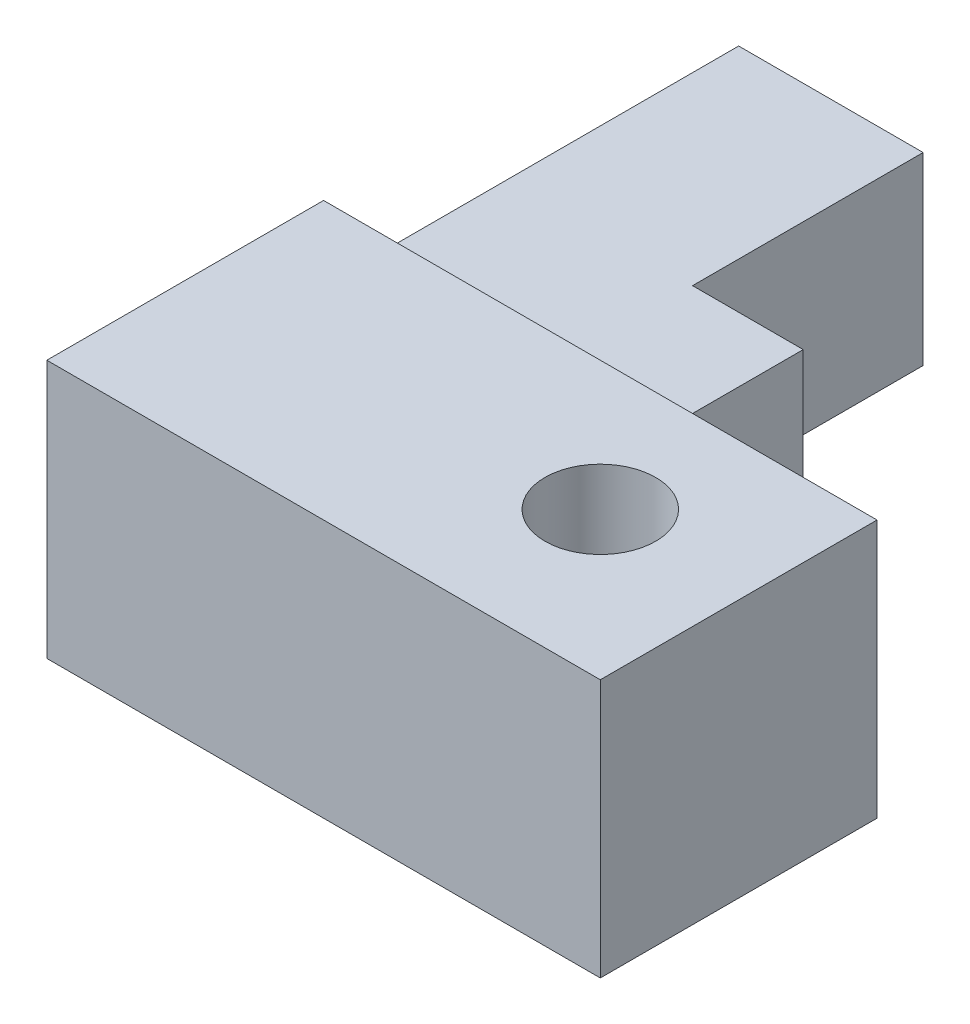
ISO-10303-21;
HEADER;
FILE_DESCRIPTION(('STEP AP214'),'2;1');
FILE_NAME('part.step','',(''),(''),'','','');
FILE_SCHEMA(('AUTOMOTIVE_DESIGN { 1 0 10303 214 1 1 1 1 }'));
ENDSEC;
DATA;
#1=APPLICATION_CONTEXT('core data for automotive mechanical design processes');
#2=APPLICATION_PROTOCOL_DEFINITION('international standard','automotive_design',2000,#1);
#3=PRODUCT_CONTEXT('',#1,'mechanical');
#4=PRODUCT('Part','Part','',(#3));
#5=PRODUCT_RELATED_PRODUCT_CATEGORY('part','',(#4));
#6=PRODUCT_DEFINITION_FORMATION('','',#4);
#7=PRODUCT_DEFINITION_CONTEXT('part definition',#1,'design');
#8=PRODUCT_DEFINITION('design','',#6,#7);
#9=PRODUCT_DEFINITION_SHAPE('','',#8);
#10=(LENGTH_UNIT() NAMED_UNIT(*) SI_UNIT(.MILLI.,.METRE.));
#11=(NAMED_UNIT(*) PLANE_ANGLE_UNIT() SI_UNIT($,.RADIAN.));
#12=(NAMED_UNIT(*) SI_UNIT($,.STERADIAN.) SOLID_ANGLE_UNIT());
#13=UNCERTAINTY_MEASURE_WITH_UNIT(LENGTH_MEASURE(1.E-05),#10,'distance_accuracy_value','');
#14=(GEOMETRIC_REPRESENTATION_CONTEXT(3) GLOBAL_UNCERTAINTY_ASSIGNED_CONTEXT((#13)) GLOBAL_UNIT_ASSIGNED_CONTEXT((#10,
#11,#12)) REPRESENTATION_CONTEXT('',''));
#15=CARTESIAN_POINT('',(0.,0.,0.));
#16=DIRECTION('',(0.,0.,1.));
#17=DIRECTION('',(1.,0.,0.));
#18=AXIS2_PLACEMENT_3D('',#15,#16,#17);
#19=CARTESIAN_POINT('',(0.,20.,0.));
#20=DIRECTION('',(-1.,0.,0.));
#21=DIRECTION('',(0.,0.,1.));
#22=AXIS2_PLACEMENT_3D('',#19,#20,#21);
#23=PLANE('',#22);
#24=DIRECTION('',(0.,-1.,0.));
#25=VECTOR('',#24,1.);
#26=CARTESIAN_POINT('',(0.,20.,-75.));
#27=LINE('',#26,#25);
#28=CARTESIAN_POINT('',(0.,20.,-75.));
#29=VERTEX_POINT('',#28);
#30=CARTESIAN_POINT('',(0.,0.,-75.));
#31=VERTEX_POINT('',#30);
#32=EDGE_CURVE('E154',#29,#31,#27,.T.);
#33=ORIENTED_EDGE('',*,*,#32,.T.);
#34=DIRECTION('',(0.,0.,-1.));
#35=VECTOR('',#34,1.);
#36=CARTESIAN_POINT('',(0.,0.,0.));
#37=LINE('',#36,#35);
#38=CARTESIAN_POINT('',(0.,0.,0.));
#39=VERTEX_POINT('',#38);
#40=EDGE_CURVE('E105',#39,#31,#37,.T.);
#41=ORIENTED_EDGE('',*,*,#40,.F.);
#42=DIRECTION('',(0.,-1.,0.));
#43=VECTOR('',#42,1.);
#44=CARTESIAN_POINT('',(0.,20.,0.));
#45=LINE('',#44,#43);
#46=CARTESIAN_POINT('',(0.,28.,0.));
#47=VERTEX_POINT('',#46);
#48=EDGE_CURVE('E11',#47,#39,#45,.T.);
#49=ORIENTED_EDGE('',*,*,#48,.F.);
#50=DIRECTION('',(0.,0.,-1.));
#51=VECTOR('',#50,1.);
#52=CARTESIAN_POINT('',(0.,28.,0.));
#53=LINE('',#52,#51);
#54=CARTESIAN_POINT('',(0.,28.,-30.));
#55=VERTEX_POINT('',#54);
#56=EDGE_CURVE('E254',#47,#55,#53,.T.);
#57=ORIENTED_EDGE('',*,*,#56,.T.);
#58=DIRECTION('',(0.,-1.,0.));
#59=VECTOR('',#58,1.);
#60=CARTESIAN_POINT('',(0.,28.,-30.));
#61=LINE('',#60,#59);
#62=CARTESIAN_POINT('',(0.,20.,-30.));
#63=VERTEX_POINT('',#62);
#64=EDGE_CURVE('E247',#55,#63,#61,.T.);
#65=ORIENTED_EDGE('',*,*,#64,.T.);
#66=DIRECTION('',(0.,0.,-1.));
#67=VECTOR('',#66,1.);
#68=CARTESIAN_POINT('',(0.,20.,0.));
#69=LINE('',#68,#67);
#70=EDGE_CURVE('E62',#63,#29,#69,.T.);
#71=ORIENTED_EDGE('',*,*,#70,.T.);
#72=EDGE_LOOP('',(#33,#41,#49,#57,#65,#71));
#73=FACE_BOUND('',#72,.T.);
#74=ADVANCED_FACE('F45',(#73),#23,.T.);
#75=CARTESIAN_POINT('',(0.,20.,0.));
#76=DIRECTION('',(0.,0.,1.));
#77=DIRECTION('',(1.,0.,0.));
#78=AXIS2_PLACEMENT_3D('',#75,#76,#77);
#79=PLANE('',#78);
#80=DIRECTION('',(-1.,0.,0.));
#81=VECTOR('',#80,1.);
#82=CARTESIAN_POINT('',(0.,0.,0.));
#83=LINE('',#82,#81);
#84=CARTESIAN_POINT('',(60.,0.,0.));
#85=VERTEX_POINT('',#84);
#86=EDGE_CURVE('E160',#85,#39,#83,.T.);
#87=ORIENTED_EDGE('',*,*,#86,.F.);
#88=DIRECTION('',(0.,-1.,0.));
#89=VECTOR('',#88,1.);
#90=CARTESIAN_POINT('',(60.,20.,0.));
#91=LINE('',#90,#89);
#92=CARTESIAN_POINT('',(60.,28.,0.));
#93=VERTEX_POINT('',#92);
#94=EDGE_CURVE('E54',#93,#85,#91,.T.);
#95=ORIENTED_EDGE('',*,*,#94,.F.);
#96=DIRECTION('',(-1.,0.,0.));
#97=VECTOR('',#96,1.);
#98=CARTESIAN_POINT('',(0.,28.,0.));
#99=LINE('',#98,#97);
#100=EDGE_CURVE('E259',#93,#47,#99,.T.);
#101=ORIENTED_EDGE('',*,*,#100,.T.);
#102=ORIENTED_EDGE('',*,*,#48,.T.);
#103=EDGE_LOOP('',(#87,#95,#101,#102));
#104=FACE_BOUND('',#103,.T.);
#105=ADVANCED_FACE('F226',(#104),#79,.T.);
#106=CARTESIAN_POINT('',(60.,20.,0.));
#107=DIRECTION('',(1.,0.,0.));
#108=DIRECTION('',(0.,0.,-1.));
#109=AXIS2_PLACEMENT_3D('',#106,#107,#108);
#110=PLANE('',#109);
#111=DIRECTION('',(0.,0.,1.));
#112=VECTOR('',#111,1.);
#113=CARTESIAN_POINT('',(60.,0.,0.));
#114=LINE('',#113,#112);
#115=CARTESIAN_POINT('',(60.,0.,-30.));
#116=VERTEX_POINT('',#115);
#117=EDGE_CURVE('E164',#116,#85,#114,.T.);
#118=ORIENTED_EDGE('',*,*,#117,.F.);
#119=DIRECTION('',(0.,-1.,0.));
#120=VECTOR('',#119,1.);
#121=CARTESIAN_POINT('',(60.,20.,-30.));
#122=LINE('',#121,#120);
#123=CARTESIAN_POINT('',(60.,28.,-30.));
#124=VERTEX_POINT('',#123);
#125=EDGE_CURVE('E210',#124,#116,#122,.T.);
#126=ORIENTED_EDGE('',*,*,#125,.F.);
#127=DIRECTION('',(0.,0.,1.));
#128=VECTOR('',#127,1.);
#129=CARTESIAN_POINT('',(60.,28.,0.));
#130=LINE('',#129,#128);
#131=EDGE_CURVE('E222',#124,#93,#130,.T.);
#132=ORIENTED_EDGE('',*,*,#131,.T.);
#133=ORIENTED_EDGE('',*,*,#94,.T.);
#134=EDGE_LOOP('',(#118,#126,#132,#133));
#135=FACE_BOUND('',#134,.T.);
#136=ADVANCED_FACE('F218',(#135),#110,.T.);
#137=CARTESIAN_POINT('',(0.,20.,-30.));
#138=DIRECTION('',(0.,0.,-1.));
#139=DIRECTION('',(-1.,0.,0.));
#140=AXIS2_PLACEMENT_3D('',#137,#138,#139);
#141=PLANE('',#140);
#142=DIRECTION('',(1.,0.,0.));
#143=VECTOR('',#142,1.);
#144=CARTESIAN_POINT('',(0.,0.,-30.));
#145=LINE('',#144,#143);
#146=CARTESIAN_POINT('',(48.,0.,-30.));
#147=VERTEX_POINT('',#146);
#148=EDGE_CURVE('E168',#147,#116,#145,.T.);
#149=ORIENTED_EDGE('',*,*,#148,.F.);
#150=DIRECTION('',(0.,-1.,0.));
#151=VECTOR('',#150,1.);
#152=CARTESIAN_POINT('',(48.,20.,-30.));
#153=LINE('',#152,#151);
#154=CARTESIAN_POINT('',(48.,20.,-30.));
#155=VERTEX_POINT('',#154);
#156=EDGE_CURVE('E207',#155,#147,#153,.T.);
#157=ORIENTED_EDGE('',*,*,#156,.F.);
#158=DIRECTION('',(-1.,0.,0.));
#159=VECTOR('',#158,1.);
#160=CARTESIAN_POINT('',(0.,20.,-30.));
#161=LINE('',#160,#159);
#162=EDGE_CURVE('E161',#155,#63,#161,.T.);
#163=ORIENTED_EDGE('',*,*,#162,.T.);
#164=ORIENTED_EDGE('',*,*,#64,.F.);
#165=DIRECTION('',(1.,0.,0.));
#166=VECTOR('',#165,1.);
#167=CARTESIAN_POINT('',(0.,28.,-30.));
#168=LINE('',#167,#166);
#169=EDGE_CURVE('E239',#55,#124,#168,.T.);
#170=ORIENTED_EDGE('',*,*,#169,.T.);
#171=ORIENTED_EDGE('',*,*,#125,.T.);
#172=EDGE_LOOP('',(#149,#157,#163,#164,#170,#171));
#173=FACE_BOUND('',#172,.T.);
#174=ADVANCED_FACE('F233',(#173),#141,.T.);
#175=CARTESIAN_POINT('',(48.,20.,0.));
#176=DIRECTION('',(1.,0.,0.));
#177=DIRECTION('',(0.,0.,-1.));
#178=AXIS2_PLACEMENT_3D('',#175,#176,#177);
#179=PLANE('',#178);
#180=DIRECTION('',(0.,0.,1.));
#181=VECTOR('',#180,1.);
#182=CARTESIAN_POINT('',(48.,0.,0.));
#183=LINE('',#182,#181);
#184=CARTESIAN_POINT('',(48.,0.,-38.));
#185=VERTEX_POINT('',#184);
#186=EDGE_CURVE('E172',#185,#147,#183,.T.);
#187=ORIENTED_EDGE('',*,*,#186,.F.);
#188=DIRECTION('',(0.,-1.,0.));
#189=VECTOR('',#188,1.);
#190=CARTESIAN_POINT('',(48.,20.,-38.));
#191=LINE('',#190,#189);
#192=CARTESIAN_POINT('',(48.,20.,-38.));
#193=VERTEX_POINT('',#192);
#194=EDGE_CURVE('E112',#193,#185,#191,.T.);
#195=ORIENTED_EDGE('',*,*,#194,.F.);
#196=DIRECTION('',(0.,0.,1.));
#197=VECTOR('',#196,1.);
#198=CARTESIAN_POINT('',(48.,20.,0.));
#199=LINE('',#198,#197);
#200=EDGE_CURVE('E271',#193,#155,#199,.T.);
#201=ORIENTED_EDGE('',*,*,#200,.T.);
#202=ORIENTED_EDGE('',*,*,#156,.T.);
#203=EDGE_LOOP('',(#187,#195,#201,#202));
#204=FACE_BOUND('',#203,.T.);
#205=ADVANCED_FACE('F285',(#204),#179,.T.);
#206=CARTESIAN_POINT('',(0.,20.,-38.));
#207=DIRECTION('',(0.,0.,-1.));
#208=DIRECTION('',(-1.,0.,0.));
#209=AXIS2_PLACEMENT_3D('',#206,#207,#208);
#210=PLANE('',#209);
#211=DIRECTION('',(1.,0.,0.));
#212=VECTOR('',#211,1.);
#213=CARTESIAN_POINT('',(0.,0.,-38.));
#214=LINE('',#213,#212);
#215=CARTESIAN_POINT('',(32.,0.,-38.));
#216=VERTEX_POINT('',#215);
#217=EDGE_CURVE('E176',#216,#185,#214,.T.);
#218=ORIENTED_EDGE('',*,*,#217,.F.);
#219=DIRECTION('',(0.,-1.,0.));
#220=VECTOR('',#219,1.);
#221=CARTESIAN_POINT('',(32.,20.,-38.));
#222=LINE('',#221,#220);
#223=CARTESIAN_POINT('',(32.,20.,-38.));
#224=VERTEX_POINT('',#223);
#225=EDGE_CURVE('E202',#224,#216,#222,.T.);
#226=ORIENTED_EDGE('',*,*,#225,.F.);
#227=DIRECTION('',(1.,0.,0.));
#228=VECTOR('',#227,1.);
#229=CARTESIAN_POINT('',(0.,20.,-38.));
#230=LINE('',#229,#228);
#231=EDGE_CURVE('E274',#224,#193,#230,.T.);
#232=ORIENTED_EDGE('',*,*,#231,.T.);
#233=ORIENTED_EDGE('',*,*,#194,.T.);
#234=EDGE_LOOP('',(#218,#226,#232,#233));
#235=FACE_BOUND('',#234,.T.);
#236=ADVANCED_FACE('F284',(#235),#210,.T.);
#237=CARTESIAN_POINT('',(32.,20.,0.));
#238=DIRECTION('',(1.,0.,0.));
#239=DIRECTION('',(0.,0.,-1.));
#240=AXIS2_PLACEMENT_3D('',#237,#238,#239);
#241=PLANE('',#240);
#242=DIRECTION('',(0.,0.,1.));
#243=VECTOR('',#242,1.);
#244=CARTESIAN_POINT('',(32.,0.,0.));
#245=LINE('',#244,#243);
#246=CARTESIAN_POINT('',(32.,0.,-50.));
#247=VERTEX_POINT('',#246);
#248=EDGE_CURVE('E180',#247,#216,#245,.T.);
#249=ORIENTED_EDGE('',*,*,#248,.F.);
#250=DIRECTION('',(0.,-1.,0.));
#251=VECTOR('',#250,1.);
#252=CARTESIAN_POINT('',(32.,20.,-50.));
#253=LINE('',#252,#251);
#254=CARTESIAN_POINT('',(32.,20.,-50.));
#255=VERTEX_POINT('',#254);
#256=EDGE_CURVE('E135',#255,#247,#253,.T.);
#257=ORIENTED_EDGE('',*,*,#256,.F.);
#258=DIRECTION('',(0.,0.,1.));
#259=VECTOR('',#258,1.);
#260=CARTESIAN_POINT('',(32.,20.,0.));
#261=LINE('',#260,#259);
#262=EDGE_CURVE('E146',#255,#224,#261,.T.);
#263=ORIENTED_EDGE('',*,*,#262,.T.);
#264=ORIENTED_EDGE('',*,*,#225,.T.);
#265=EDGE_LOOP('',(#249,#257,#263,#264));
#266=FACE_BOUND('',#265,.T.);
#267=ADVANCED_FACE('F280',(#266),#241,.T.);
#268=CARTESIAN_POINT('',(0.,20.,-50.));
#269=DIRECTION('',(0.,0.,-1.));
#270=DIRECTION('',(-1.,0.,0.));
#271=AXIS2_PLACEMENT_3D('',#268,#269,#270);
#272=PLANE('',#271);
#273=DIRECTION('',(1.,0.,0.));
#274=VECTOR('',#273,1.);
#275=CARTESIAN_POINT('',(0.,0.,-50.));
#276=LINE('',#275,#274);
#277=CARTESIAN_POINT('',(20.,0.,-50.));
#278=VERTEX_POINT('',#277);
#279=EDGE_CURVE('E130',#278,#247,#276,.T.);
#280=ORIENTED_EDGE('',*,*,#279,.F.);
#281=DIRECTION('',(0.,-1.,0.));
#282=VECTOR('',#281,1.);
#283=CARTESIAN_POINT('',(20.,20.,-50.));
#284=LINE('',#283,#282);
#285=CARTESIAN_POINT('',(20.,20.,-50.));
#286=VERTEX_POINT('',#285);
#287=EDGE_CURVE('E125',#286,#278,#284,.T.);
#288=ORIENTED_EDGE('',*,*,#287,.F.);
#289=DIRECTION('',(1.,0.,0.));
#290=VECTOR('',#289,1.);
#291=CARTESIAN_POINT('',(0.,20.,-50.));
#292=LINE('',#291,#290);
#293=EDGE_CURVE('E128',#286,#255,#292,.T.);
#294=ORIENTED_EDGE('',*,*,#293,.T.);
#295=ORIENTED_EDGE('',*,*,#256,.T.);
#296=EDGE_LOOP('',(#280,#288,#294,#295));
#297=FACE_BOUND('',#296,.T.);
#298=ADVANCED_FACE('F127',(#297),#272,.T.);
#299=CARTESIAN_POINT('',(20.,20.,0.));
#300=DIRECTION('',(1.,0.,0.));
#301=DIRECTION('',(0.,0.,-1.));
#302=AXIS2_PLACEMENT_3D('',#299,#300,#301);
#303=PLANE('',#302);
#304=DIRECTION('',(0.,0.,1.));
#305=VECTOR('',#304,1.);
#306=CARTESIAN_POINT('',(20.,0.,0.));
#307=LINE('',#306,#305);
#308=CARTESIAN_POINT('',(20.,0.,-75.));
#309=VERTEX_POINT('',#308);
#310=EDGE_CURVE('E186',#309,#278,#307,.T.);
#311=ORIENTED_EDGE('',*,*,#310,.F.);
#312=DIRECTION('',(0.,-1.,0.));
#313=VECTOR('',#312,1.);
#314=CARTESIAN_POINT('',(20.,20.,-75.));
#315=LINE('',#314,#313);
#316=CARTESIAN_POINT('',(20.,20.,-75.));
#317=VERTEX_POINT('',#316);
#318=EDGE_CURVE('E97',#317,#309,#315,.T.);
#319=ORIENTED_EDGE('',*,*,#318,.F.);
#320=DIRECTION('',(0.,0.,1.));
#321=VECTOR('',#320,1.);
#322=CARTESIAN_POINT('',(20.,20.,0.));
#323=LINE('',#322,#321);
#324=EDGE_CURVE('E143',#317,#286,#323,.T.);
#325=ORIENTED_EDGE('',*,*,#324,.T.);
#326=ORIENTED_EDGE('',*,*,#287,.T.);
#327=EDGE_LOOP('',(#311,#319,#325,#326));
#328=FACE_BOUND('',#327,.T.);
#329=ADVANCED_FACE('F149',(#328),#303,.T.);
#330=CARTESIAN_POINT('',(0.,20.,-75.));
#331=DIRECTION('',(0.,0.,-1.));
#332=DIRECTION('',(-1.,0.,0.));
#333=AXIS2_PLACEMENT_3D('',#330,#331,#332);
#334=PLANE('',#333);
#335=DIRECTION('',(1.,0.,0.));
#336=VECTOR('',#335,1.);
#337=CARTESIAN_POINT('',(0.,0.,-75.));
#338=LINE('',#337,#336);
#339=EDGE_CURVE('E189',#31,#309,#338,.T.);
#340=ORIENTED_EDGE('',*,*,#339,.F.);
#341=ORIENTED_EDGE('',*,*,#32,.F.);
#342=DIRECTION('',(1.,0.,0.));
#343=VECTOR('',#342,1.);
#344=CARTESIAN_POINT('',(0.,20.,-75.));
#345=LINE('',#344,#343);
#346=EDGE_CURVE('E151',#29,#317,#345,.T.);
#347=ORIENTED_EDGE('',*,*,#346,.T.);
#348=ORIENTED_EDGE('',*,*,#318,.T.);
#349=EDGE_LOOP('',(#340,#341,#347,#348));
#350=FACE_BOUND('',#349,.T.);
#351=ADVANCED_FACE('F282',(#350),#334,.T.);
#352=CARTESIAN_POINT('',(44.,20.,-16.));
#353=DIRECTION('',(0.,-1.,0.));
#354=DIRECTION('',(0.,0.,-1.));
#355=AXIS2_PLACEMENT_3D('',#352,#353,#354);
#356=CYLINDRICAL_SURFACE('',#355,6.00000000000001);
#357=CARTESIAN_POINT('',(44.,0.,-16.));
#358=DIRECTION('',(0.,1.,0.));
#359=DIRECTION('',(0.,0.,1.));
#360=AXIS2_PLACEMENT_3D('',#357,#358,#359);
#361=CIRCLE('',#360,6.00000000000001);
#362=CARTESIAN_POINT('',(44.,0.,-9.99999999999999));
#363=VERTEX_POINT('',#362);
#364=EDGE_CURVE('E192',#363,#363,#361,.T.);
#365=ORIENTED_EDGE('',*,*,#364,.F.);
#366=EDGE_LOOP('',(#365));
#367=FACE_BOUND('',#366,.T.);
#368=CARTESIAN_POINT('',(44.,28.,-16.));
#369=DIRECTION('',(0.,1.,0.));
#370=DIRECTION('',(0.,0.,1.));
#371=AXIS2_PLACEMENT_3D('',#368,#369,#370);
#372=CIRCLE('',#371,6.00000000000001);
#373=CARTESIAN_POINT('',(44.,28.,-9.99999999999999));
#374=VERTEX_POINT('',#373);
#375=EDGE_CURVE('E256',#374,#374,#372,.T.);
#376=ORIENTED_EDGE('',*,*,#375,.T.);
#377=EDGE_LOOP('',(#376));
#378=FACE_BOUND('',#377,.T.);
#379=ADVANCED_FACE('F322',(#367,#378),#356,.F.);
#380=CARTESIAN_POINT('',(0.,20.,0.));
#381=DIRECTION('',(0.,1.,0.));
#382=DIRECTION('',(0.,0.,1.));
#383=AXIS2_PLACEMENT_3D('',#380,#381,#382);
#384=PLANE('',#383);
#385=ORIENTED_EDGE('',*,*,#162,.F.);
#386=ORIENTED_EDGE('',*,*,#200,.F.);
#387=ORIENTED_EDGE('',*,*,#231,.F.);
#388=ORIENTED_EDGE('',*,*,#262,.F.);
#389=ORIENTED_EDGE('',*,*,#293,.F.);
#390=ORIENTED_EDGE('',*,*,#324,.F.);
#391=ORIENTED_EDGE('',*,*,#346,.F.);
#392=ORIENTED_EDGE('',*,*,#70,.F.);
#393=EDGE_LOOP('',(#385,#386,#387,#388,#389,#390,#391,#392));
#394=FACE_BOUND('',#393,.T.);
#395=ADVANCED_FACE('F141',(#394),#384,.T.);
#396=CARTESIAN_POINT('',(0.,0.,0.));
#397=DIRECTION('',(0.,1.,0.));
#398=DIRECTION('',(0.,0.,1.));
#399=AXIS2_PLACEMENT_3D('',#396,#397,#398);
#400=PLANE('',#399);
#401=ORIENTED_EDGE('',*,*,#186,.T.);
#402=ORIENTED_EDGE('',*,*,#148,.T.);
#403=ORIENTED_EDGE('',*,*,#117,.T.);
#404=ORIENTED_EDGE('',*,*,#86,.T.);
#405=ORIENTED_EDGE('',*,*,#40,.T.);
#406=ORIENTED_EDGE('',*,*,#339,.T.);
#407=ORIENTED_EDGE('',*,*,#310,.T.);
#408=ORIENTED_EDGE('',*,*,#279,.T.);
#409=ORIENTED_EDGE('',*,*,#248,.T.);
#410=ORIENTED_EDGE('',*,*,#217,.T.);
#411=EDGE_LOOP('',(#401,#402,#403,#404,#405,#406,#407,#408,#409,#410));
#412=FACE_BOUND('',#411,.T.);
#413=ORIENTED_EDGE('',*,*,#364,.T.);
#414=EDGE_LOOP('',(#413));
#415=FACE_BOUND('',#414,.T.);
#416=ADVANCED_FACE('F228',(#412,#415),#400,.F.);
#417=CARTESIAN_POINT('',(0.,28.,0.));
#418=DIRECTION('',(0.,1.,0.));
#419=DIRECTION('',(0.,0.,1.));
#420=AXIS2_PLACEMENT_3D('',#417,#418,#419);
#421=PLANE('',#420);
#422=ORIENTED_EDGE('',*,*,#375,.F.);
#423=EDGE_LOOP('',(#422));
#424=FACE_BOUND('',#423,.T.);
#425=ORIENTED_EDGE('',*,*,#169,.F.);
#426=ORIENTED_EDGE('',*,*,#56,.F.);
#427=ORIENTED_EDGE('',*,*,#100,.F.);
#428=ORIENTED_EDGE('',*,*,#131,.F.);
#429=EDGE_LOOP('',(#425,#426,#427,#428));
#430=FACE_BOUND('',#429,.T.);
#431=ADVANCED_FACE('F253',(#424,#430),#421,.T.);
#432=CLOSED_SHELL('',(#74,#105,#136,#174,#205,#236,#267,#298,#329,#351,#379,#395,#416,#431));
#433=MANIFOLD_SOLID_BREP('B2',#432);
#434=ADVANCED_BREP_SHAPE_REPRESENTATION('',(#18,#433),#14);
#435=SHAPE_DEFINITION_REPRESENTATION(#9,#434);
ENDSEC;
END-ISO-10303-21;
